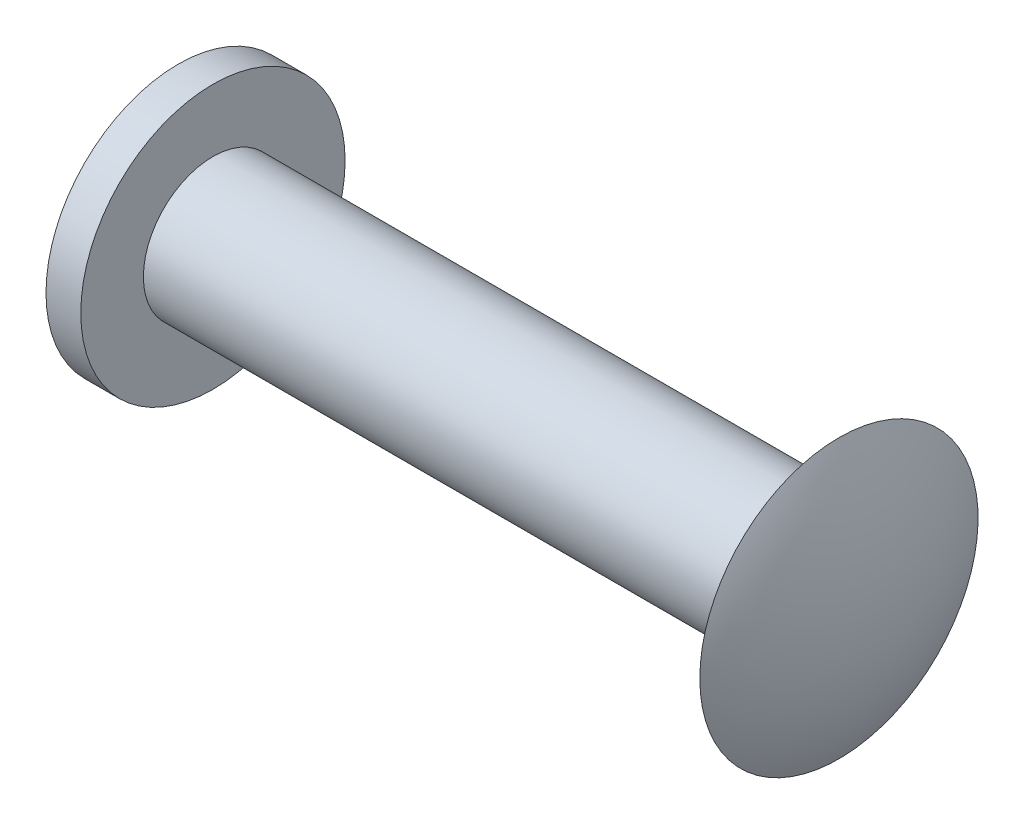
ISO-10303-21;
HEADER;
FILE_DESCRIPTION(('STEP AP214'),'2;1');
FILE_NAME('part.step','',(''),(''),'','','');
FILE_SCHEMA(('AUTOMOTIVE_DESIGN { 1 0 10303 214 1 1 1 1 }'));
ENDSEC;
DATA;
#1=APPLICATION_CONTEXT('core data for automotive mechanical design processes');
#2=APPLICATION_PROTOCOL_DEFINITION('international standard','automotive_design',2000,#1);
#3=PRODUCT_CONTEXT('',#1,'mechanical');
#4=PRODUCT('Part','Part','',(#3));
#5=PRODUCT_RELATED_PRODUCT_CATEGORY('part','',(#4));
#6=PRODUCT_DEFINITION_FORMATION('','',#4);
#7=PRODUCT_DEFINITION_CONTEXT('part definition',#1,'design');
#8=PRODUCT_DEFINITION('design','',#6,#7);
#9=PRODUCT_DEFINITION_SHAPE('','',#8);
#10=(LENGTH_UNIT() NAMED_UNIT(*) SI_UNIT(.MILLI.,.METRE.));
#11=(NAMED_UNIT(*) PLANE_ANGLE_UNIT() SI_UNIT($,.RADIAN.));
#12=(NAMED_UNIT(*) SI_UNIT($,.STERADIAN.) SOLID_ANGLE_UNIT());
#13=UNCERTAINTY_MEASURE_WITH_UNIT(LENGTH_MEASURE(1.E-05),#10,'distance_accuracy_value','');
#14=(GEOMETRIC_REPRESENTATION_CONTEXT(3) GLOBAL_UNCERTAINTY_ASSIGNED_CONTEXT((#13)) GLOBAL_UNIT_ASSIGNED_CONTEXT((#10,
#11,#12)) REPRESENTATION_CONTEXT('',''));
#15=CARTESIAN_POINT('',(0.,0.,0.));
#16=DIRECTION('',(0.,0.,1.));
#17=DIRECTION('',(1.,0.,0.));
#18=AXIS2_PLACEMENT_3D('',#15,#16,#17);
#19=CARTESIAN_POINT('',(0.,0.,0.));
#20=DIRECTION('',(1.,0.,0.));
#21=DIRECTION('',(0.,0.,-1.));
#22=AXIS2_PLACEMENT_3D('',#19,#20,#21);
#23=PLANE('',#22);
#24=CARTESIAN_POINT('',(0.,0.,0.));
#25=DIRECTION('',(-1.,0.,0.));
#26=DIRECTION('',(0.,0.,1.));
#27=AXIS2_PLACEMENT_3D('',#24,#25,#26);
#28=CIRCLE('',#27,1.9);
#29=CARTESIAN_POINT('',(0.,0.,1.9));
#30=VERTEX_POINT('',#29);
#31=EDGE_CURVE('E10',#30,#30,#28,.T.);
#32=ORIENTED_EDGE('',*,*,#31,.T.);
#33=EDGE_LOOP('',(#32));
#34=FACE_BOUND('',#33,.T.);
#35=ADVANCED_FACE('F39',(#34),#23,.F.);
#36=CARTESIAN_POINT('',(9.5,0.,0.));
#37=DIRECTION('',(-1.,0.,0.));
#38=DIRECTION('',(0.,0.,1.));
#39=AXIS2_PLACEMENT_3D('',#36,#37,#38);
#40=CYLINDRICAL_SURFACE('',#39,1.9);
#41=ORIENTED_EDGE('',*,*,#31,.F.);
#42=EDGE_LOOP('',(#41));
#43=FACE_BOUND('',#42,.T.);
#44=CARTESIAN_POINT('',(0.5,0.,0.));
#45=DIRECTION('',(-1.,0.,0.));
#46=DIRECTION('',(0.,0.,1.));
#47=AXIS2_PLACEMENT_3D('',#44,#45,#46);
#48=CIRCLE('',#47,1.9);
#49=CARTESIAN_POINT('',(0.5,0.,1.9));
#50=VERTEX_POINT('',#49);
#51=EDGE_CURVE('E46',#50,#50,#48,.T.);
#52=ORIENTED_EDGE('',*,*,#51,.T.);
#53=EDGE_LOOP('',(#52));
#54=FACE_BOUND('',#53,.T.);
#55=ADVANCED_FACE('F78',(#43,#54),#40,.T.);
#56=CARTESIAN_POINT('',(0.5,1.9,0.));
#57=DIRECTION('',(-1.,0.,0.));
#58=DIRECTION('',(0.,0.,1.));
#59=AXIS2_PLACEMENT_3D('',#56,#57,#58);
#60=PLANE('',#59);
#61=ORIENTED_EDGE('',*,*,#51,.F.);
#62=EDGE_LOOP('',(#61));
#63=FACE_BOUND('',#62,.T.);
#64=CARTESIAN_POINT('',(0.5,0.,0.));
#65=DIRECTION('',(-1.,0.,0.));
#66=DIRECTION('',(0.,0.,1.));
#67=AXIS2_PLACEMENT_3D('',#64,#65,#66);
#68=CIRCLE('',#67,1.);
#69=CARTESIAN_POINT('',(0.5,0.,1.));
#70=VERTEX_POINT('',#69);
#71=EDGE_CURVE('E53',#70,#70,#68,.T.);
#72=ORIENTED_EDGE('',*,*,#71,.T.);
#73=EDGE_LOOP('',(#72));
#74=FACE_BOUND('',#73,.T.);
#75=ADVANCED_FACE('F81',(#63,#74),#60,.F.);
#76=CARTESIAN_POINT('',(9.5,0.,0.));
#77=DIRECTION('',(-1.,0.,0.));
#78=DIRECTION('',(0.,0.,1.));
#79=AXIS2_PLACEMENT_3D('',#76,#77,#78);
#80=CYLINDRICAL_SURFACE('',#79,1.);
#81=ORIENTED_EDGE('',*,*,#71,.F.);
#82=EDGE_LOOP('',(#81));
#83=FACE_BOUND('',#82,.T.);
#84=CARTESIAN_POINT('',(9.5,0.,0.));
#85=DIRECTION('',(-1.,0.,0.));
#86=DIRECTION('',(0.,0.,1.));
#87=AXIS2_PLACEMENT_3D('',#84,#85,#86);
#88=CIRCLE('',#87,1.);
#89=CARTESIAN_POINT('',(9.5,0.,1.));
#90=VERTEX_POINT('',#89);
#91=EDGE_CURVE('E57',#90,#90,#88,.T.);
#92=ORIENTED_EDGE('',*,*,#91,.T.);
#93=EDGE_LOOP('',(#92));
#94=FACE_BOUND('',#93,.T.);
#95=ADVANCED_FACE('F74',(#83,#94),#80,.T.);
#96=CARTESIAN_POINT('',(9.5,1.,0.));
#97=DIRECTION('',(1.,0.,0.));
#98=DIRECTION('',(0.,0.,-1.));
#99=AXIS2_PLACEMENT_3D('',#96,#97,#98);
#100=PLANE('',#99);
#101=ORIENTED_EDGE('',*,*,#91,.F.);
#102=EDGE_LOOP('',(#101));
#103=FACE_BOUND('',#102,.T.);
#104=CARTESIAN_POINT('',(9.5,0.,0.));
#105=DIRECTION('',(-1.,0.,0.));
#106=DIRECTION('',(0.,0.,1.));
#107=AXIS2_PLACEMENT_3D('',#104,#105,#106);
#108=CIRCLE('',#107,2.);
#109=CARTESIAN_POINT('',(9.5,0.,2.));
#110=VERTEX_POINT('',#109);
#111=EDGE_CURVE('E62',#110,#110,#108,.T.);
#112=ORIENTED_EDGE('',*,*,#111,.T.);
#113=EDGE_LOOP('',(#112));
#114=FACE_BOUND('',#113,.T.);
#115=ADVANCED_FACE('F67',(#103,#114),#100,.F.);
#116=CARTESIAN_POINT('',(5.75000000000002,0.,0.));
#117=DIRECTION('',(-1.,0.,0.));
#118=DIRECTION('',(0.,1.,0.));
#119=AXIS2_PLACEMENT_3D('',#116,#117,#118);
#120=SPHERICAL_SURFACE('',#119,4.24999999999998);
#121=ORIENTED_EDGE('',*,*,#111,.F.);
#122=EDGE_LOOP('',(#121));
#123=FACE_BOUND('',#122,.T.);
#124=ADVANCED_FACE('F69',(#123),#120,.T.);
#125=CLOSED_SHELL('',(#35,#55,#75,#95,#115,#124));
#126=MANIFOLD_SOLID_BREP('B2',#125);
#127=ADVANCED_BREP_SHAPE_REPRESENTATION('',(#18,#126),#14);
#128=SHAPE_DEFINITION_REPRESENTATION(#9,#127);
ENDSEC;
END-ISO-10303-21;
